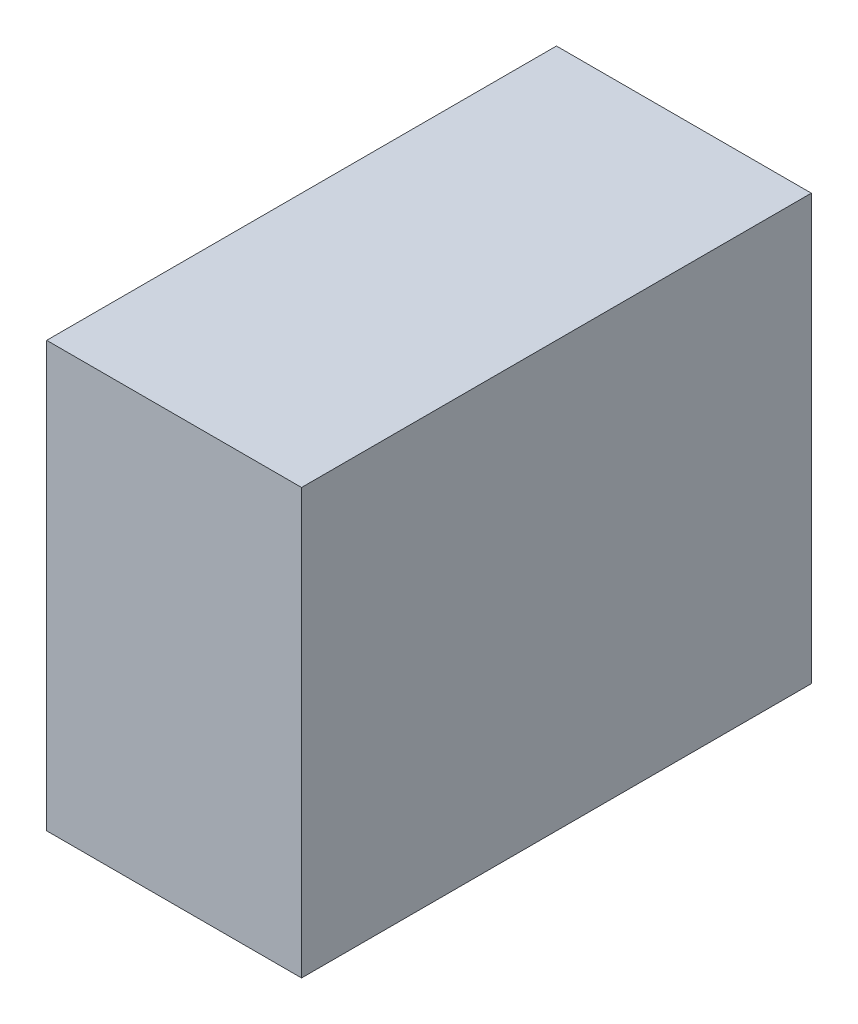
ISO-10303-21;
HEADER;
FILE_DESCRIPTION(('STEP AP214'),'2;1');
FILE_NAME('part.step','',(''),(''),'','','');
FILE_SCHEMA(('AUTOMOTIVE_DESIGN { 1 0 10303 214 1 1 1 1 }'));
ENDSEC;
DATA;
#1=APPLICATION_CONTEXT('core data for automotive mechanical design processes');
#2=APPLICATION_PROTOCOL_DEFINITION('international standard','automotive_design',2000,#1);
#3=PRODUCT_CONTEXT('',#1,'mechanical');
#4=PRODUCT('Part','Part','',(#3));
#5=PRODUCT_RELATED_PRODUCT_CATEGORY('part','',(#4));
#6=PRODUCT_DEFINITION_FORMATION('','',#4);
#7=PRODUCT_DEFINITION_CONTEXT('part definition',#1,'design');
#8=PRODUCT_DEFINITION('design','',#6,#7);
#9=PRODUCT_DEFINITION_SHAPE('','',#8);
#10=(LENGTH_UNIT() NAMED_UNIT(*) SI_UNIT(.MILLI.,.METRE.));
#11=(NAMED_UNIT(*) PLANE_ANGLE_UNIT() SI_UNIT($,.RADIAN.));
#12=(NAMED_UNIT(*) SI_UNIT($,.STERADIAN.) SOLID_ANGLE_UNIT());
#13=UNCERTAINTY_MEASURE_WITH_UNIT(LENGTH_MEASURE(1.E-05),#10,'distance_accuracy_value','');
#14=(GEOMETRIC_REPRESENTATION_CONTEXT(3) GLOBAL_UNCERTAINTY_ASSIGNED_CONTEXT((#13)) GLOBAL_UNIT_ASSIGNED_CONTEXT((#10,
#11,#12)) REPRESENTATION_CONTEXT('',''));
#15=CARTESIAN_POINT('',(0.,0.,0.));
#16=DIRECTION('',(0.,0.,1.));
#17=DIRECTION('',(1.,0.,0.));
#18=AXIS2_PLACEMENT_3D('',#15,#16,#17);
#19=CARTESIAN_POINT('',(19.05,-31.75,76.2));
#20=DIRECTION('',(-1.,0.,0.));
#21=DIRECTION('',(0.,0.,1.));
#22=AXIS2_PLACEMENT_3D('',#19,#20,#21);
#23=PLANE('',#22);
#24=DIRECTION('',(0.,1.,0.));
#25=VECTOR('',#24,1.);
#26=CARTESIAN_POINT('',(19.05,-31.75,0.));
#27=LINE('',#26,#25);
#28=CARTESIAN_POINT('',(19.05,-31.75,0.));
#29=VERTEX_POINT('',#28);
#30=CARTESIAN_POINT('',(19.05,31.75,0.));
#31=VERTEX_POINT('',#30);
#32=EDGE_CURVE('E96',#29,#31,#27,.T.);
#33=ORIENTED_EDGE('',*,*,#32,.T.);
#34=DIRECTION('',(0.,0.,-1.));
#35=VECTOR('',#34,1.);
#36=CARTESIAN_POINT('',(19.05,31.75,76.2));
#37=LINE('',#36,#35);
#38=CARTESIAN_POINT('',(19.05,31.75,76.2));
#39=VERTEX_POINT('',#38);
#40=EDGE_CURVE('E11',#39,#31,#37,.T.);
#41=ORIENTED_EDGE('',*,*,#40,.F.);
#42=DIRECTION('',(0.,1.,0.));
#43=VECTOR('',#42,1.);
#44=CARTESIAN_POINT('',(19.05,-31.75,76.2));
#45=LINE('',#44,#43);
#46=CARTESIAN_POINT('',(19.05,-31.75,76.2));
#47=VERTEX_POINT('',#46);
#48=EDGE_CURVE('E84',#47,#39,#45,.T.);
#49=ORIENTED_EDGE('',*,*,#48,.F.);
#50=DIRECTION('',(0.,0.,-1.));
#51=VECTOR('',#50,1.);
#52=CARTESIAN_POINT('',(19.05,-31.75,76.2));
#53=LINE('',#52,#51);
#54=EDGE_CURVE('E92',#47,#29,#53,.T.);
#55=ORIENTED_EDGE('',*,*,#54,.T.);
#56=EDGE_LOOP('',(#33,#41,#49,#55));
#57=FACE_BOUND('',#56,.T.);
#58=ADVANCED_FACE('F33',(#57),#23,.F.);
#59=CARTESIAN_POINT('',(-19.05,31.75,76.2));
#60=DIRECTION('',(0.,-1.,0.));
#61=DIRECTION('',(0.,0.,-1.));
#62=AXIS2_PLACEMENT_3D('',#59,#60,#61);
#63=PLANE('',#62);
#64=DIRECTION('',(-1.,0.,0.));
#65=VECTOR('',#64,1.);
#66=CARTESIAN_POINT('',(-19.05,31.75,0.));
#67=LINE('',#66,#65);
#68=CARTESIAN_POINT('',(-19.05,31.75,0.));
#69=VERTEX_POINT('',#68);
#70=EDGE_CURVE('E88',#31,#69,#67,.T.);
#71=ORIENTED_EDGE('',*,*,#70,.T.);
#72=DIRECTION('',(0.,0.,-1.));
#73=VECTOR('',#72,1.);
#74=CARTESIAN_POINT('',(-19.05,31.75,76.2));
#75=LINE('',#74,#73);
#76=CARTESIAN_POINT('',(-19.05,31.75,76.2));
#77=VERTEX_POINT('',#76);
#78=EDGE_CURVE('E41',#77,#69,#75,.T.);
#79=ORIENTED_EDGE('',*,*,#78,.F.);
#80=DIRECTION('',(-1.,0.,0.));
#81=VECTOR('',#80,1.);
#82=CARTESIAN_POINT('',(-19.05,31.75,76.2));
#83=LINE('',#82,#81);
#84=EDGE_CURVE('E79',#39,#77,#83,.T.);
#85=ORIENTED_EDGE('',*,*,#84,.F.);
#86=ORIENTED_EDGE('',*,*,#40,.T.);
#87=EDGE_LOOP('',(#71,#79,#85,#86));
#88=FACE_BOUND('',#87,.T.);
#89=ADVANCED_FACE('F87',(#88),#63,.F.);
#90=CARTESIAN_POINT('',(-19.05,-31.75,76.2));
#91=DIRECTION('',(1.,0.,0.));
#92=DIRECTION('',(0.,0.,-1.));
#93=AXIS2_PLACEMENT_3D('',#90,#91,#92);
#94=PLANE('',#93);
#95=DIRECTION('',(0.,-1.,0.));
#96=VECTOR('',#95,1.);
#97=CARTESIAN_POINT('',(-19.05,-31.75,0.));
#98=LINE('',#97,#96);
#99=CARTESIAN_POINT('',(-19.05,-31.75,0.));
#100=VERTEX_POINT('',#99);
#101=EDGE_CURVE('E66',#69,#100,#98,.T.);
#102=ORIENTED_EDGE('',*,*,#101,.T.);
#103=DIRECTION('',(0.,0.,-1.));
#104=VECTOR('',#103,1.);
#105=CARTESIAN_POINT('',(-19.05,-31.75,76.2));
#106=LINE('',#105,#104);
#107=CARTESIAN_POINT('',(-19.05,-31.75,76.2));
#108=VERTEX_POINT('',#107);
#109=EDGE_CURVE('E89',#108,#100,#106,.T.);
#110=ORIENTED_EDGE('',*,*,#109,.F.);
#111=DIRECTION('',(0.,-1.,0.));
#112=VECTOR('',#111,1.);
#113=CARTESIAN_POINT('',(-19.05,-31.75,76.2));
#114=LINE('',#113,#112);
#115=EDGE_CURVE('E82',#77,#108,#114,.T.);
#116=ORIENTED_EDGE('',*,*,#115,.F.);
#117=ORIENTED_EDGE('',*,*,#78,.T.);
#118=EDGE_LOOP('',(#102,#110,#116,#117));
#119=FACE_BOUND('',#118,.T.);
#120=ADVANCED_FACE('F90',(#119),#94,.F.);
#121=CARTESIAN_POINT('',(-19.05,-31.75,76.2));
#122=DIRECTION('',(0.,1.,0.));
#123=DIRECTION('',(0.,0.,1.));
#124=AXIS2_PLACEMENT_3D('',#121,#122,#123);
#125=PLANE('',#124);
#126=DIRECTION('',(1.,0.,0.));
#127=VECTOR('',#126,1.);
#128=CARTESIAN_POINT('',(-19.05,-31.75,0.));
#129=LINE('',#128,#127);
#130=EDGE_CURVE('E72',#100,#29,#129,.T.);
#131=ORIENTED_EDGE('',*,*,#130,.T.);
#132=ORIENTED_EDGE('',*,*,#54,.F.);
#133=DIRECTION('',(1.,0.,0.));
#134=VECTOR('',#133,1.);
#135=CARTESIAN_POINT('',(-19.05,-31.75,76.2));
#136=LINE('',#135,#134);
#137=EDGE_CURVE('E49',#108,#47,#136,.T.);
#138=ORIENTED_EDGE('',*,*,#137,.F.);
#139=ORIENTED_EDGE('',*,*,#109,.T.);
#140=EDGE_LOOP('',(#131,#132,#138,#139));
#141=FACE_BOUND('',#140,.T.);
#142=ADVANCED_FACE('F103',(#141),#125,.F.);
#143=CARTESIAN_POINT('',(0.,0.,76.2));
#144=DIRECTION('',(0.,0.,-1.));
#145=DIRECTION('',(-1.,0.,0.));
#146=AXIS2_PLACEMENT_3D('',#143,#144,#145);
#147=PLANE('',#146);
#148=ORIENTED_EDGE('',*,*,#48,.T.);
#149=ORIENTED_EDGE('',*,*,#84,.T.);
#150=ORIENTED_EDGE('',*,*,#115,.T.);
#151=ORIENTED_EDGE('',*,*,#137,.T.);
#152=EDGE_LOOP('',(#148,#149,#150,#151));
#153=FACE_BOUND('',#152,.T.);
#154=ADVANCED_FACE('F80',(#153),#147,.F.);
#155=CARTESIAN_POINT('',(0.,0.,0.));
#156=DIRECTION('',(0.,0.,-1.));
#157=DIRECTION('',(-1.,0.,0.));
#158=AXIS2_PLACEMENT_3D('',#155,#156,#157);
#159=PLANE('',#158);
#160=ORIENTED_EDGE('',*,*,#32,.F.);
#161=ORIENTED_EDGE('',*,*,#130,.F.);
#162=ORIENTED_EDGE('',*,*,#101,.F.);
#163=ORIENTED_EDGE('',*,*,#70,.F.);
#164=EDGE_LOOP('',(#160,#161,#162,#163));
#165=FACE_BOUND('',#164,.T.);
#166=ADVANCED_FACE('F106',(#165),#159,.T.);
#167=CLOSED_SHELL('',(#58,#89,#120,#142,#154,#166));
#168=MANIFOLD_SOLID_BREP('B2',#167);
#169=ADVANCED_BREP_SHAPE_REPRESENTATION('',(#18,#168),#14);
#170=SHAPE_DEFINITION_REPRESENTATION(#9,#169);
ENDSEC;
END-ISO-10303-21;
